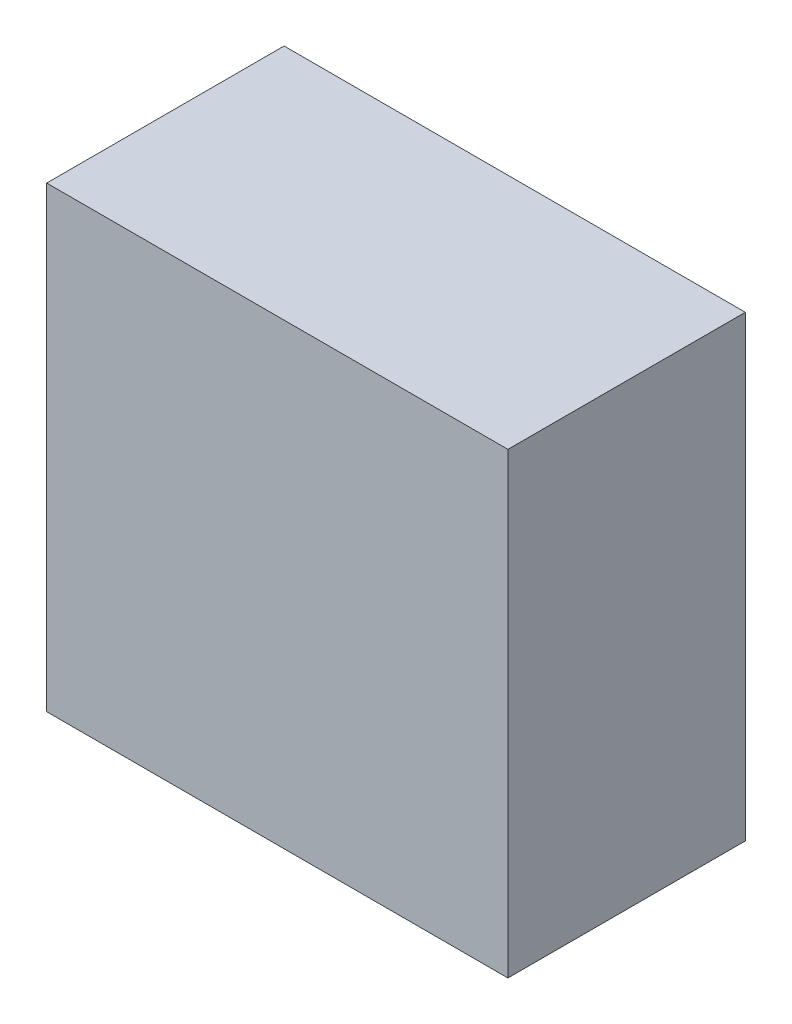
ISO-10303-21;
HEADER;
FILE_DESCRIPTION(('STEP AP214'),'2;1');
FILE_NAME('part.step','',(''),(''),'','','');
FILE_SCHEMA(('AUTOMOTIVE_DESIGN { 1 0 10303 214 1 1 1 1 }'));
ENDSEC;
DATA;
#1=APPLICATION_CONTEXT('core data for automotive mechanical design processes');
#2=APPLICATION_PROTOCOL_DEFINITION('international standard','automotive_design',2000,#1);
#3=PRODUCT_CONTEXT('',#1,'mechanical');
#4=PRODUCT('Part','Part','',(#3));
#5=PRODUCT_RELATED_PRODUCT_CATEGORY('part','',(#4));
#6=PRODUCT_DEFINITION_FORMATION('','',#4);
#7=PRODUCT_DEFINITION_CONTEXT('part definition',#1,'design');
#8=PRODUCT_DEFINITION('design','',#6,#7);
#9=PRODUCT_DEFINITION_SHAPE('','',#8);
#10=(LENGTH_UNIT() NAMED_UNIT(*) SI_UNIT(.MILLI.,.METRE.));
#11=(NAMED_UNIT(*) PLANE_ANGLE_UNIT() SI_UNIT($,.RADIAN.));
#12=(NAMED_UNIT(*) SI_UNIT($,.STERADIAN.) SOLID_ANGLE_UNIT());
#13=UNCERTAINTY_MEASURE_WITH_UNIT(LENGTH_MEASURE(1.E-05),#10,'distance_accuracy_value','');
#14=(GEOMETRIC_REPRESENTATION_CONTEXT(3) GLOBAL_UNCERTAINTY_ASSIGNED_CONTEXT((#13)) GLOBAL_UNIT_ASSIGNED_CONTEXT((#10,
#11,#12)) REPRESENTATION_CONTEXT('',''));
#15=CARTESIAN_POINT('',(0.,0.,0.));
#16=DIRECTION('',(0.,0.,1.));
#17=DIRECTION('',(1.,0.,0.));
#18=AXIS2_PLACEMENT_3D('',#15,#16,#17);
#19=CARTESIAN_POINT('',(0.68000118,0.67499992,0.));
#20=DIRECTION('',(0.99999999999823,1.88148170224543E-06,0.));
#21=DIRECTION('',(1.88148170224543E-06,-0.99999999999823,0.));
#22=AXIS2_PLACEMENT_3D('',#19,#20,#21);
#23=PLANE('',#22);
#24=DIRECTION('',(0.,0.,1.));
#25=VECTOR('',#24,1.);
#26=CARTESIAN_POINT('',(0.68000118,0.67499992,0.));
#27=LINE('',#26,#25);
#28=CARTESIAN_POINT('',(0.68000118,0.67499992,0.));
#29=VERTEX_POINT('',#28);
#30=CARTESIAN_POINT('',(0.68000118,0.67499992,0.70000114));
#31=VERTEX_POINT('',#30);
#32=EDGE_CURVE('E11',#29,#31,#27,.T.);
#33=ORIENTED_EDGE('',*,*,#32,.T.);
#34=DIRECTION('',(1.88148170224543E-06,-0.99999999999823,0.));
#35=VECTOR('',#34,1.);
#36=CARTESIAN_POINT('',(0.68000118,0.67499992,0.70000114));
#37=LINE('',#36,#35);
#38=CARTESIAN_POINT('',(0.68000372,-0.67499992,0.70000114));
#39=VERTEX_POINT('',#38);
#40=EDGE_CURVE('E23',#31,#39,#37,.T.);
#41=ORIENTED_EDGE('',*,*,#40,.T.);
#42=DIRECTION('',(0.,0.,1.));
#43=VECTOR('',#42,1.);
#44=CARTESIAN_POINT('',(0.68000372,-0.67499992,0.));
#45=LINE('',#44,#43);
#46=CARTESIAN_POINT('',(0.68000372,-0.67499992,0.));
#47=VERTEX_POINT('',#46);
#48=EDGE_CURVE('E84',#47,#39,#45,.T.);
#49=ORIENTED_EDGE('',*,*,#48,.F.);
#50=DIRECTION('',(1.88148170224543E-06,-0.99999999999823,0.));
#51=VECTOR('',#50,1.);
#52=CARTESIAN_POINT('',(0.68000118,0.67499992,0.));
#53=LINE('',#52,#51);
#54=EDGE_CURVE('E82',#29,#47,#53,.T.);
#55=ORIENTED_EDGE('',*,*,#54,.F.);
#56=EDGE_LOOP('',(#33,#41,#49,#55));
#57=FACE_BOUND('',#56,.T.);
#58=ADVANCED_FACE('F16',(#57),#23,.T.);
#59=CARTESIAN_POINT('',(0.68000372,-0.67499992,0.));
#60=DIRECTION('',(0.,-1.,0.));
#61=DIRECTION('',(-1.,0.,0.));
#62=AXIS2_PLACEMENT_3D('',#59,#60,#61);
#63=PLANE('',#62);
#64=ORIENTED_EDGE('',*,*,#48,.T.);
#65=DIRECTION('',(-1.,0.,0.));
#66=VECTOR('',#65,1.);
#67=CARTESIAN_POINT('',(0.68000372,-0.67499992,0.70000114));
#68=LINE('',#67,#66);
#69=CARTESIAN_POINT('',(-0.67999864,-0.67499992,0.70000114));
#70=VERTEX_POINT('',#69);
#71=EDGE_CURVE('E80',#39,#70,#68,.T.);
#72=ORIENTED_EDGE('',*,*,#71,.T.);
#73=DIRECTION('',(0.,0.,1.));
#74=VECTOR('',#73,1.);
#75=CARTESIAN_POINT('',(-0.67999864,-0.67499992,0.));
#76=LINE('',#75,#74);
#77=CARTESIAN_POINT('',(-0.67999864,-0.67499992,0.));
#78=VERTEX_POINT('',#77);
#79=EDGE_CURVE('E78',#78,#70,#76,.T.);
#80=ORIENTED_EDGE('',*,*,#79,.F.);
#81=DIRECTION('',(-1.,0.,0.));
#82=VECTOR('',#81,1.);
#83=CARTESIAN_POINT('',(0.68000372,-0.67499992,0.));
#84=LINE('',#83,#82);
#85=EDGE_CURVE('E69',#47,#78,#84,.T.);
#86=ORIENTED_EDGE('',*,*,#85,.F.);
#87=EDGE_LOOP('',(#64,#72,#80,#86));
#88=FACE_BOUND('',#87,.T.);
#89=ADVANCED_FACE('F89',(#88),#63,.T.);
#90=CARTESIAN_POINT('',(-0.67999864,-0.67499992,0.));
#91=DIRECTION('',(-0.99999999999823,-1.88148170224543E-06,0.));
#92=DIRECTION('',(-1.88148170224543E-06,0.99999999999823,0.));
#93=AXIS2_PLACEMENT_3D('',#90,#91,#92);
#94=PLANE('',#93);
#95=ORIENTED_EDGE('',*,*,#79,.T.);
#96=DIRECTION('',(-1.88148170224543E-06,0.99999999999823,0.));
#97=VECTOR('',#96,1.);
#98=CARTESIAN_POINT('',(-0.67999864,-0.67499992,0.70000114));
#99=LINE('',#98,#97);
#100=CARTESIAN_POINT('',(-0.68000118,0.67499992,0.70000114));
#101=VERTEX_POINT('',#100);
#102=EDGE_CURVE('E59',#70,#101,#99,.T.);
#103=ORIENTED_EDGE('',*,*,#102,.T.);
#104=DIRECTION('',(0.,0.,1.));
#105=VECTOR('',#104,1.);
#106=CARTESIAN_POINT('',(-0.68000118,0.67499992,0.));
#107=LINE('',#106,#105);
#108=CARTESIAN_POINT('',(-0.68000118,0.67499992,0.));
#109=VERTEX_POINT('',#108);
#110=EDGE_CURVE('E53',#109,#101,#107,.T.);
#111=ORIENTED_EDGE('',*,*,#110,.F.);
#112=DIRECTION('',(-1.88148170224543E-06,0.99999999999823,0.));
#113=VECTOR('',#112,1.);
#114=CARTESIAN_POINT('',(-0.67999864,-0.67499992,0.));
#115=LINE('',#114,#113);
#116=EDGE_CURVE('E57',#78,#109,#115,.T.);
#117=ORIENTED_EDGE('',*,*,#116,.F.);
#118=EDGE_LOOP('',(#95,#103,#111,#117));
#119=FACE_BOUND('',#118,.T.);
#120=ADVANCED_FACE('F56',(#119),#94,.T.);
#121=CARTESIAN_POINT('',(-0.68000118,0.67499992,0.));
#122=DIRECTION('',(0.,1.,0.));
#123=DIRECTION('',(1.,0.,0.));
#124=AXIS2_PLACEMENT_3D('',#121,#122,#123);
#125=PLANE('',#124);
#126=ORIENTED_EDGE('',*,*,#110,.T.);
#127=DIRECTION('',(1.,0.,0.));
#128=VECTOR('',#127,1.);
#129=CARTESIAN_POINT('',(-0.68000118,0.67499992,0.70000114));
#130=LINE('',#129,#128);
#131=EDGE_CURVE('E70',#101,#31,#130,.T.);
#132=ORIENTED_EDGE('',*,*,#131,.T.);
#133=ORIENTED_EDGE('',*,*,#32,.F.);
#134=DIRECTION('',(1.,0.,0.));
#135=VECTOR('',#134,1.);
#136=CARTESIAN_POINT('',(-0.68000118,0.67499992,0.));
#137=LINE('',#136,#135);
#138=EDGE_CURVE('E67',#109,#29,#137,.T.);
#139=ORIENTED_EDGE('',*,*,#138,.F.);
#140=EDGE_LOOP('',(#126,#132,#133,#139));
#141=FACE_BOUND('',#140,.T.);
#142=ADVANCED_FACE('F72',(#141),#125,.T.);
#143=CARTESIAN_POINT('',(0.68000118,0.67499992,0.));
#144=DIRECTION('',(0.,0.,1.));
#145=DIRECTION('',(1.,0.,0.));
#146=AXIS2_PLACEMENT_3D('',#143,#144,#145);
#147=PLANE('',#146);
#148=ORIENTED_EDGE('',*,*,#54,.T.);
#149=ORIENTED_EDGE('',*,*,#85,.T.);
#150=ORIENTED_EDGE('',*,*,#116,.T.);
#151=ORIENTED_EDGE('',*,*,#138,.T.);
#152=EDGE_LOOP('',(#148,#149,#150,#151));
#153=FACE_BOUND('',#152,.T.);
#154=ADVANCED_FACE('F66',(#153),#147,.F.);
#155=CARTESIAN_POINT('',(0.68000118,0.67499992,0.70000114));
#156=DIRECTION('',(0.,0.,1.));
#157=DIRECTION('',(1.,0.,0.));
#158=AXIS2_PLACEMENT_3D('',#155,#156,#157);
#159=PLANE('',#158);
#160=ORIENTED_EDGE('',*,*,#131,.F.);
#161=ORIENTED_EDGE('',*,*,#102,.F.);
#162=ORIENTED_EDGE('',*,*,#71,.F.);
#163=ORIENTED_EDGE('',*,*,#40,.F.);
#164=EDGE_LOOP('',(#160,#161,#162,#163));
#165=FACE_BOUND('',#164,.T.);
#166=ADVANCED_FACE('F90',(#165),#159,.T.);
#167=CLOSED_SHELL('',(#58,#89,#120,#142,#154,#166));
#168=MANIFOLD_SOLID_BREP('B1',#167);
#169=ADVANCED_BREP_SHAPE_REPRESENTATION('',(#18,#168),#14);
#170=SHAPE_DEFINITION_REPRESENTATION(#9,#169);
ENDSEC;
END-ISO-10303-21;
